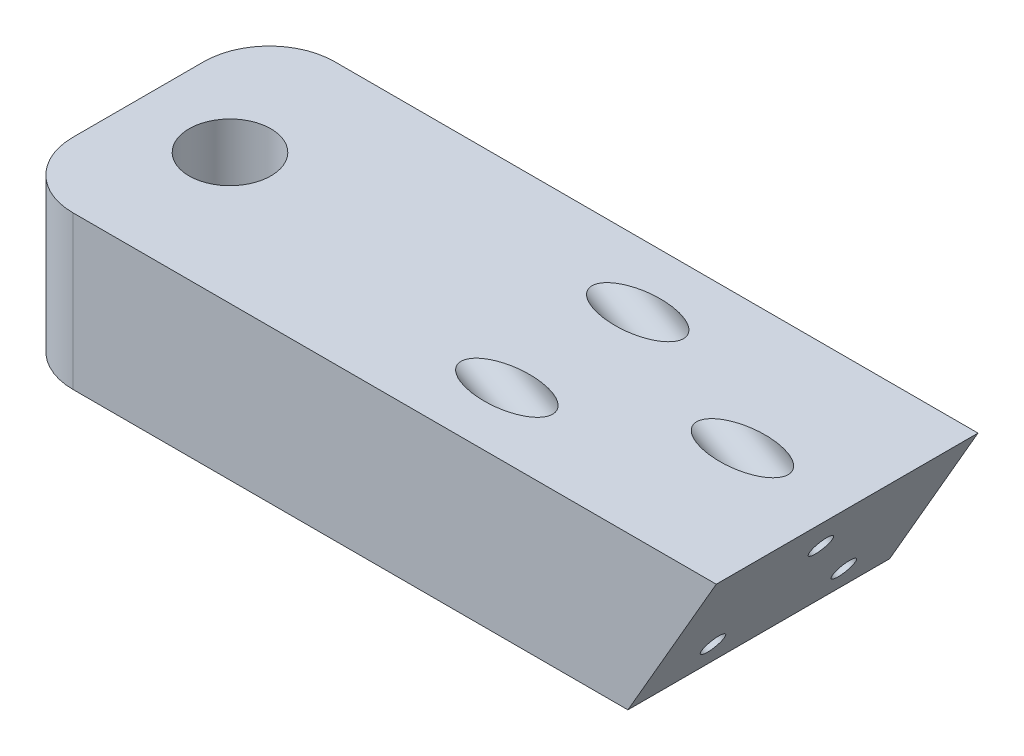
ISO-10303-21;
HEADER;
FILE_DESCRIPTION(('STEP AP214'),'2;1');
FILE_NAME('part.step','',(''),(''),'','','');
FILE_SCHEMA(('AUTOMOTIVE_DESIGN { 1 0 10303 214 1 1 1 1 }'));
ENDSEC;
DATA;
#1=APPLICATION_CONTEXT('core data for automotive mechanical design processes');
#2=APPLICATION_PROTOCOL_DEFINITION('international standard','automotive_design',2000,#1);
#3=PRODUCT_CONTEXT('',#1,'mechanical');
#4=PRODUCT('Part','Part','',(#3));
#5=PRODUCT_RELATED_PRODUCT_CATEGORY('part','',(#4));
#6=PRODUCT_DEFINITION_FORMATION('','',#4);
#7=PRODUCT_DEFINITION_CONTEXT('part definition',#1,'design');
#8=PRODUCT_DEFINITION('design','',#6,#7);
#9=PRODUCT_DEFINITION_SHAPE('','',#8);
#10=(LENGTH_UNIT() NAMED_UNIT(*) SI_UNIT(.MILLI.,.METRE.));
#11=(NAMED_UNIT(*) PLANE_ANGLE_UNIT() SI_UNIT($,.RADIAN.));
#12=(NAMED_UNIT(*) SI_UNIT($,.STERADIAN.) SOLID_ANGLE_UNIT());
#13=UNCERTAINTY_MEASURE_WITH_UNIT(LENGTH_MEASURE(1.E-05),#10,'distance_accuracy_value','');
#14=(GEOMETRIC_REPRESENTATION_CONTEXT(3) GLOBAL_UNCERTAINTY_ASSIGNED_CONTEXT((#13)) GLOBAL_UNIT_ASSIGNED_CONTEXT((#10,
#11,#12)) REPRESENTATION_CONTEXT('',''));
#15=CARTESIAN_POINT('',(0.,0.,0.));
#16=DIRECTION('',(0.,0.,1.));
#17=DIRECTION('',(1.,0.,0.));
#18=AXIS2_PLACEMENT_3D('',#15,#16,#17);
#19=CARTESIAN_POINT('',(-13.9992872394734,32.1506350946109,40.));
#20=DIRECTION('',(0.,-1.,0.));
#21=DIRECTION('',(1.,0.,0.));
#22=AXIS2_PLACEMENT_3D('',#19,#20,#21);
#23=PLANE('',#22);
#24=CARTESIAN_POINT('',(52.3134665205247,32.1506350946109,30.));
#25=DIRECTION('',(0.,-1.,0.));
#26=DIRECTION('',(1.,0.,0.));
#27=AXIS2_PLACEMENT_3D('',#24,#25,#26);
#28=ELLIPSE('',#27,7.00000000000014,3.5);
#29=CARTESIAN_POINT('',(59.3134665205249,32.1506350946109,30.));
#30=VERTEX_POINT('',#29);
#31=EDGE_CURVE('E330',#30,#30,#28,.F.);
#32=ORIENTED_EDGE('',*,*,#31,.F.);
#33=EDGE_LOOP('',(#32));
#34=FACE_BOUND('',#33,.T.);
#35=CARTESIAN_POINT('',(78.3134665205253,32.1506350946109,20.));
#36=DIRECTION('',(0.,-1.,0.));
#37=DIRECTION('',(1.,0.,0.));
#38=AXIS2_PLACEMENT_3D('',#35,#36,#37);
#39=ELLIPSE('',#38,7.00000000000013,3.5);
#40=CARTESIAN_POINT('',(85.3134665205255,32.1506350946109,20.));
#41=VERTEX_POINT('',#40);
#42=EDGE_CURVE('E346',#41,#41,#39,.F.);
#43=ORIENTED_EDGE('',*,*,#42,.F.);
#44=EDGE_LOOP('',(#43));
#45=FACE_BOUND('',#44,.T.);
#46=CARTESIAN_POINT('',(52.3134665205248,32.1506350946109,10.));
#47=DIRECTION('',(0.,-1.,0.));
#48=DIRECTION('',(1.,0.,0.));
#49=AXIS2_PLACEMENT_3D('',#46,#47,#48);
#50=ELLIPSE('',#49,7.00000000000014,3.5);
#51=CARTESIAN_POINT('',(59.3134665205249,32.1506350946109,10.));
#52=VERTEX_POINT('',#51);
#53=EDGE_CURVE('E343',#52,#52,#50,.F.);
#54=ORIENTED_EDGE('',*,*,#53,.F.);
#55=EDGE_LOOP('',(#54));
#56=FACE_BOUND('',#55,.T.);
#57=CARTESIAN_POINT('',(0.,32.1506350946109,20.));
#58=DIRECTION('',(0.,1.,0.));
#59=DIRECTION('',(0.,0.,1.));
#60=AXIS2_PLACEMENT_3D('',#57,#58,#59);
#61=CIRCLE('',#60,6.25);
#62=CARTESIAN_POINT('',(0.,32.1506350946109,26.25));
#63=VERTEX_POINT('',#62);
#64=EDGE_CURVE('E153',#63,#63,#61,.T.);
#65=ORIENTED_EDGE('',*,*,#64,.F.);
#66=EDGE_LOOP('',(#65));
#67=FACE_BOUND('',#66,.T.);
#68=DIRECTION('',(-1.,0.,0.));
#69=VECTOR('',#68,1.);
#70=CARTESIAN_POINT('',(-13.9992872394734,32.1506350946109,0.));
#71=LINE('',#70,#69);
#72=CARTESIAN_POINT('',(94.3134665205266,32.1506350946109,0.));
#73=VERTEX_POINT('',#72);
#74=CARTESIAN_POINT('',(-3.99928723947336,32.1506350946109,0.));
#75=VERTEX_POINT('',#74);
#76=EDGE_CURVE('E121',#73,#75,#71,.T.);
#77=ORIENTED_EDGE('',*,*,#76,.T.);
#78=CARTESIAN_POINT('',(-3.99928723947336,32.1506350946109,10.));
#79=DIRECTION('',(0.,-1.,0.));
#80=DIRECTION('',(1.,0.,0.));
#81=AXIS2_PLACEMENT_3D('',#78,#79,#80);
#82=CIRCLE('',#81,10.);
#83=CARTESIAN_POINT('',(-13.9992872394734,32.1506350946109,10.));
#84=VERTEX_POINT('',#83);
#85=EDGE_CURVE('E47',#75,#84,#82,.F.);
#86=ORIENTED_EDGE('',*,*,#85,.T.);
#87=DIRECTION('',(0.,0.,-1.));
#88=VECTOR('',#87,1.);
#89=CARTESIAN_POINT('',(-13.9992872394734,32.1506350946109,40.));
#90=LINE('',#89,#88);
#91=CARTESIAN_POINT('',(-13.9992872394734,32.1506350946109,30.));
#92=VERTEX_POINT('',#91);
#93=EDGE_CURVE('E128',#92,#84,#90,.T.);
#94=ORIENTED_EDGE('',*,*,#93,.F.);
#95=CARTESIAN_POINT('',(-3.99928723947336,32.1506350946109,30.));
#96=DIRECTION('',(0.,-1.,0.));
#97=DIRECTION('',(1.,0.,0.));
#98=AXIS2_PLACEMENT_3D('',#95,#96,#97);
#99=CIRCLE('',#98,10.);
#100=CARTESIAN_POINT('',(-3.99928723947336,32.1506350946109,40.));
#101=VERTEX_POINT('',#100);
#102=EDGE_CURVE('E54',#92,#101,#99,.F.);
#103=ORIENTED_EDGE('',*,*,#102,.T.);
#104=DIRECTION('',(-1.,0.,0.));
#105=VECTOR('',#104,1.);
#106=CARTESIAN_POINT('',(-13.9992872394734,32.1506350946109,40.));
#107=LINE('',#106,#105);
#108=CARTESIAN_POINT('',(94.3134665205266,32.1506350946109,40.));
#109=VERTEX_POINT('',#108);
#110=EDGE_CURVE('E103',#109,#101,#107,.T.);
#111=ORIENTED_EDGE('',*,*,#110,.F.);
#112=DIRECTION('',(0.,0.,-1.));
#113=VECTOR('',#112,1.);
#114=CARTESIAN_POINT('',(94.3134665205266,32.1506350946109,40.));
#115=LINE('',#114,#113);
#116=EDGE_CURVE('E113',#109,#73,#115,.T.);
#117=ORIENTED_EDGE('',*,*,#116,.T.);
#118=EDGE_LOOP('',(#77,#86,#94,#103,#111,#117));
#119=FACE_BOUND('',#118,.T.);
#120=ADVANCED_FACE('F39',(#34,#45,#56,#67,#119),#23,.F.);
#121=CARTESIAN_POINT('',(-13.9992872394736,8.7679491924309,40.));
#122=DIRECTION('',(1.,0.,0.));
#123=DIRECTION('',(0.,1.,0.));
#124=AXIS2_PLACEMENT_3D('',#121,#122,#123);
#125=PLANE('',#124);
#126=CARTESIAN_POINT('',(-13.9992872394736,20.150635094611,20.));
#127=DIRECTION('',(-1.,0.,0.));
#128=DIRECTION('',(0.,0.,1.));
#129=AXIS2_PLACEMENT_3D('',#126,#127,#128);
#130=CIRCLE('',#129,2.3);
#131=CARTESIAN_POINT('',(-13.9992872394736,20.150635094611,22.3));
#132=VERTEX_POINT('',#131);
#133=EDGE_CURVE('E156',#132,#132,#130,.T.);
#134=ORIENTED_EDGE('',*,*,#133,.F.);
#135=EDGE_LOOP('',(#134));
#136=FACE_BOUND('',#135,.T.);
#137=ORIENTED_EDGE('',*,*,#93,.T.);
#138=DIRECTION('',(0.,-1.,0.));
#139=VECTOR('',#138,1.);
#140=CARTESIAN_POINT('',(-13.9992872394736,8.7679491924309,10.));
#141=LINE('',#140,#139);
#142=CARTESIAN_POINT('',(-13.9992872394736,8.7679491924309,10.));
#143=VERTEX_POINT('',#142);
#144=EDGE_CURVE('E133',#84,#143,#141,.T.);
#145=ORIENTED_EDGE('',*,*,#144,.T.);
#146=DIRECTION('',(0.,0.,-1.));
#147=VECTOR('',#146,1.);
#148=CARTESIAN_POINT('',(-13.9992872394736,8.7679491924309,40.));
#149=LINE('',#148,#147);
#150=CARTESIAN_POINT('',(-13.9992872394736,8.7679491924309,30.));
#151=VERTEX_POINT('',#150);
#152=EDGE_CURVE('E112',#151,#143,#149,.T.);
#153=ORIENTED_EDGE('',*,*,#152,.F.);
#154=DIRECTION('',(0.,-1.,0.));
#155=VECTOR('',#154,1.);
#156=CARTESIAN_POINT('',(-13.9992872394734,32.1506350946109,30.));
#157=LINE('',#156,#155);
#158=EDGE_CURVE('E131',#151,#92,#157,.F.);
#159=ORIENTED_EDGE('',*,*,#158,.T.);
#160=EDGE_LOOP('',(#137,#145,#153,#159));
#161=FACE_BOUND('',#160,.T.);
#162=ADVANCED_FACE('F145',(#136,#161),#125,.F.);
#163=CARTESIAN_POINT('',(80.8134665205267,8.76794919243105,40.));
#164=DIRECTION('',(0.,1.,0.));
#165=DIRECTION('',(-1.,0.,0.));
#166=AXIS2_PLACEMENT_3D('',#163,#164,#165);
#167=PLANE('',#166);
#168=CARTESIAN_POINT('',(0.,8.76794919243092,20.));
#169=DIRECTION('',(0.,1.,0.));
#170=DIRECTION('',(-1.,0.,0.));
#171=AXIS2_PLACEMENT_3D('',#168,#169,#170);
#172=CIRCLE('',#171,6.25);
#173=CARTESIAN_POINT('',(-6.25,8.76794919243092,20.));
#174=VERTEX_POINT('',#173);
#175=EDGE_CURVE('E123',#174,#174,#172,.F.);
#176=ORIENTED_EDGE('',*,*,#175,.F.);
#177=EDGE_LOOP('',(#176));
#178=FACE_BOUND('',#177,.T.);
#179=ORIENTED_EDGE('',*,*,#152,.T.);
#180=CARTESIAN_POINT('',(-3.99928723947356,8.76794919243092,10.));
#181=DIRECTION('',(0.,1.,0.));
#182=DIRECTION('',(-1.,0.,0.));
#183=AXIS2_PLACEMENT_3D('',#180,#181,#182);
#184=CIRCLE('',#183,10.);
#185=CARTESIAN_POINT('',(-3.99928723947356,8.76794919243092,0.));
#186=VERTEX_POINT('',#185);
#187=EDGE_CURVE('E138',#143,#186,#184,.F.);
#188=ORIENTED_EDGE('',*,*,#187,.T.);
#189=DIRECTION('',(1.,0.,0.));
#190=VECTOR('',#189,1.);
#191=CARTESIAN_POINT('',(80.8134665205267,8.76794919243105,0.));
#192=LINE('',#191,#190);
#193=CARTESIAN_POINT('',(80.8134665205267,8.76794919243105,0.));
#194=VERTEX_POINT('',#193);
#195=EDGE_CURVE('E109',#186,#194,#192,.T.);
#196=ORIENTED_EDGE('',*,*,#195,.T.);
#197=DIRECTION('',(0.,0.,-1.));
#198=VECTOR('',#197,1.);
#199=CARTESIAN_POINT('',(80.8134665205267,8.76794919243105,40.));
#200=LINE('',#199,#198);
#201=CARTESIAN_POINT('',(80.8134665205267,8.76794919243105,40.));
#202=VERTEX_POINT('',#201);
#203=EDGE_CURVE('E106',#202,#194,#200,.T.);
#204=ORIENTED_EDGE('',*,*,#203,.F.);
#205=DIRECTION('',(1.,0.,0.));
#206=VECTOR('',#205,1.);
#207=CARTESIAN_POINT('',(80.8134665205267,8.76794919243105,40.));
#208=LINE('',#207,#206);
#209=CARTESIAN_POINT('',(-3.99928723947356,8.76794919243092,40.));
#210=VERTEX_POINT('',#209);
#211=EDGE_CURVE('E95',#210,#202,#208,.T.);
#212=ORIENTED_EDGE('',*,*,#211,.F.);
#213=CARTESIAN_POINT('',(-3.99928723947356,8.76794919243092,30.));
#214=DIRECTION('',(0.,1.,0.));
#215=DIRECTION('',(-1.,0.,0.));
#216=AXIS2_PLACEMENT_3D('',#213,#214,#215);
#217=CIRCLE('',#216,10.);
#218=EDGE_CURVE('E136',#210,#151,#217,.F.);
#219=ORIENTED_EDGE('',*,*,#218,.T.);
#220=EDGE_LOOP('',(#179,#188,#196,#204,#212,#219));
#221=FACE_BOUND('',#220,.T.);
#222=ADVANCED_FACE('F108',(#178,#221),#167,.F.);
#223=CARTESIAN_POINT('',(94.3134665205266,32.1506350946109,40.));
#224=DIRECTION('',(-0.866025403784441,0.499999999999996,0.));
#225=DIRECTION('',(-0.499999999999996,-0.866025403784441,0.));
#226=AXIS2_PLACEMENT_3D('',#223,#224,#225);
#227=PLANE('',#226);
#228=CARTESIAN_POINT('',(83.8134665205261,13.9641016151374,30.));
#229=DIRECTION('',(0.866025403784444,-0.49999999999999,0.));
#230=DIRECTION('',(0.49999999999999,0.866025403784444,0.));
#231=AXIS2_PLACEMENT_3D('',#228,#229,#230);
#232=CIRCLE('',#231,1.75);
#233=CARTESIAN_POINT('',(84.6884665205261,15.4796460717601,30.));
#234=VERTEX_POINT('',#233);
#235=EDGE_CURVE('E167',#234,#234,#232,.T.);
#236=ORIENTED_EDGE('',*,*,#235,.F.);
#237=EDGE_LOOP('',(#236));
#238=FACE_BOUND('',#237,.T.);
#239=CARTESIAN_POINT('',(83.8134665205261,13.9641016151374,10.));
#240=DIRECTION('',(0.866025403784444,-0.49999999999999,0.));
#241=DIRECTION('',(0.49999999999999,0.866025403784444,0.));
#242=AXIS2_PLACEMENT_3D('',#239,#240,#241);
#243=CIRCLE('',#242,1.75);
#244=CARTESIAN_POINT('',(84.6884665205261,15.4796460717601,10.));
#245=VERTEX_POINT('',#244);
#246=EDGE_CURVE('E326',#245,#245,#243,.T.);
#247=ORIENTED_EDGE('',*,*,#246,.F.);
#248=EDGE_LOOP('',(#247));
#249=FACE_BOUND('',#248,.T.);
#250=CARTESIAN_POINT('',(90.313466520526,25.2224318643351,20.));
#251=DIRECTION('',(0.866025403784444,-0.49999999999999,0.));
#252=DIRECTION('',(0.49999999999999,0.866025403784444,0.));
#253=AXIS2_PLACEMENT_3D('',#250,#251,#252);
#254=CIRCLE('',#253,1.75);
#255=CARTESIAN_POINT('',(91.188466520526,26.7379763209579,20.));
#256=VERTEX_POINT('',#255);
#257=EDGE_CURVE('E168',#256,#256,#254,.T.);
#258=ORIENTED_EDGE('',*,*,#257,.F.);
#259=EDGE_LOOP('',(#258));
#260=FACE_BOUND('',#259,.T.);
#261=DIRECTION('',(0.499999999999996,0.866025403784441,0.));
#262=VECTOR('',#261,1.);
#263=CARTESIAN_POINT('',(94.3134665205266,32.1506350946109,0.));
#264=LINE('',#263,#262);
#265=EDGE_CURVE('E125',#194,#73,#264,.T.);
#266=ORIENTED_EDGE('',*,*,#265,.T.);
#267=ORIENTED_EDGE('',*,*,#116,.F.);
#268=DIRECTION('',(0.499999999999996,0.866025403784441,0.));
#269=VECTOR('',#268,1.);
#270=CARTESIAN_POINT('',(94.3134665205266,32.1506350946109,40.));
#271=LINE('',#270,#269);
#272=EDGE_CURVE('E99',#202,#109,#271,.T.);
#273=ORIENTED_EDGE('',*,*,#272,.F.);
#274=ORIENTED_EDGE('',*,*,#203,.T.);
#275=EDGE_LOOP('',(#266,#267,#273,#274));
#276=FACE_BOUND('',#275,.T.);
#277=ADVANCED_FACE('F115',(#238,#249,#260,#276),#227,.F.);
#278=CARTESIAN_POINT('',(0.,0.,40.));
#279=DIRECTION('',(0.,0.,1.));
#280=DIRECTION('',(1.,0.,0.));
#281=AXIS2_PLACEMENT_3D('',#278,#279,#280);
#282=PLANE('',#281);
#283=ORIENTED_EDGE('',*,*,#110,.T.);
#284=DIRECTION('',(0.,-1.,0.));
#285=VECTOR('',#284,1.);
#286=CARTESIAN_POINT('',(-3.99928723947356,8.76794919243081,40.));
#287=LINE('',#286,#285);
#288=EDGE_CURVE('E11',#101,#210,#287,.T.);
#289=ORIENTED_EDGE('',*,*,#288,.T.);
#290=ORIENTED_EDGE('',*,*,#211,.T.);
#291=ORIENTED_EDGE('',*,*,#272,.T.);
#292=EDGE_LOOP('',(#283,#289,#290,#291));
#293=FACE_BOUND('',#292,.T.);
#294=ADVANCED_FACE('F97',(#293),#282,.T.);
#295=CARTESIAN_POINT('',(0.,0.,0.));
#296=DIRECTION('',(0.,0.,1.));
#297=DIRECTION('',(1.,0.,0.));
#298=AXIS2_PLACEMENT_3D('',#295,#296,#297);
#299=PLANE('',#298);
#300=ORIENTED_EDGE('',*,*,#195,.F.);
#301=DIRECTION('',(0.,-1.,0.));
#302=VECTOR('',#301,1.);
#303=CARTESIAN_POINT('',(-3.99928723947364,0.,0.));
#304=LINE('',#303,#302);
#305=EDGE_CURVE('E62',#186,#75,#304,.F.);
#306=ORIENTED_EDGE('',*,*,#305,.T.);
#307=ORIENTED_EDGE('',*,*,#76,.F.);
#308=ORIENTED_EDGE('',*,*,#265,.F.);
#309=EDGE_LOOP('',(#300,#306,#307,#308));
#310=FACE_BOUND('',#309,.T.);
#311=ADVANCED_FACE('F149',(#310),#299,.F.);
#312=CARTESIAN_POINT('',(0.,8.7669491924309,20.));
#313=DIRECTION('',(0.,1.,0.));
#314=DIRECTION('',(0.,0.,1.));
#315=AXIS2_PLACEMENT_3D('',#312,#313,#314);
#316=CYLINDRICAL_SURFACE('',#315,6.25);
#317=CARTESIAN_POINT('',(-5.81141118834315,20.150635094611,22.3));
#318=CARTESIAN_POINT('',(-5.81140767854029,20.0262349910175,22.3000038481121));
#319=CARTESIAN_POINT('',(-5.815449011967,19.9018608016973,22.2898736835966));
#320=CARTESIAN_POINT('',(-5.83106947619173,19.6568510429988,22.2497966904476));
#321=CARTESIAN_POINT('',(-5.84264860846846,19.5362154743537,22.2198498579266));
#322=CARTESIAN_POINT('',(-5.87185920641133,19.302285669965,22.1413778079585));
#323=CARTESIAN_POINT('',(-5.88947663886882,19.1889751299867,22.0928956373541));
#324=CARTESIAN_POINT('',(-5.92875658515922,18.9720528893392,21.9788808127611));
#325=CARTESIAN_POINT('',(-5.95042026386244,18.8684439945966,21.9133432465672));
#326=CARTESIAN_POINT('',(-5.99651288522111,18.668910520997,21.7637205584753));
#327=CARTESIAN_POINT('',(-6.02102110703377,18.5735159467542,21.6789528753252));
#328=CARTESIAN_POINT('',(-6.06937851653934,18.397924958151,21.4947258952571));
#329=CARTESIAN_POINT('',(-6.0932275693907,18.3177316340338,21.3952636183905));
#330=CARTESIAN_POINT('',(-6.13851753932007,18.172292826898,21.1804736957482));
#331=CARTESIAN_POINT('',(-6.15985461759466,18.10761980743,21.0647345724535));
#332=CARTESIAN_POINT('',(-6.19676691205868,17.9988803506946,20.8230960334692));
#333=CARTESIAN_POINT('',(-6.21234404676242,17.9548070508065,20.6972000178747));
#334=CARTESIAN_POINT('',(-6.23541878196318,17.8903660866304,20.4443909454117));
#335=CARTESIAN_POINT('',(-6.24322613728438,17.8690867570082,20.3177390914064));
#336=CARTESIAN_POINT('',(-6.25099115563097,17.8479205953181,20.0624375118087));
#337=CARTESIAN_POINT('',(-6.25095127713425,17.8480270632449,19.9337884245641));
#338=CARTESIAN_POINT('',(-6.24322563089208,17.8690902162203,19.6846643488513));
#339=CARTESIAN_POINT('',(-6.23590444276585,17.8890527036873,19.5640920520568));
#340=CARTESIAN_POINT('',(-6.21491337694768,17.947593830874,19.328146410934));
#341=CARTESIAN_POINT('',(-6.20124305181802,17.9861737826149,19.2127734336419));
#342=CARTESIAN_POINT('',(-6.16866891497011,18.0813365799642,18.9885379065182));
#343=CARTESIAN_POINT('',(-6.1496927734531,18.1381699772057,18.8797926290868));
#344=CARTESIAN_POINT('',(-6.1084370455403,18.2680075745326,18.6731165773091));
#345=CARTESIAN_POINT('',(-6.08615641653763,18.3410168819222,18.5751892332321));
#346=CARTESIAN_POINT('',(-6.03911059480564,18.5059635063816,18.3870601179165));
#347=CARTESIAN_POINT('',(-6.0142761510227,18.5987376487608,18.2976082542774));
#348=CARTESIAN_POINT('',(-5.96593865104424,18.7981312774686,18.1352565779265));
#349=CARTESIAN_POINT('',(-5.94243590517129,18.904753971992,18.0623606113898));
#350=CARTESIAN_POINT('',(-5.89899603621424,19.1316730611617,17.9338296756853));
#351=CARTESIAN_POINT('',(-5.87914270994335,19.2522066467475,17.8785828767576));
#352=CARTESIAN_POINT('',(-5.84621698564789,19.5017885045393,17.7894499051083));
#353=CARTESIAN_POINT('',(-5.83314098239039,19.6308322084732,17.7555523734617));
#354=CARTESIAN_POINT('',(-5.81609470171305,19.8863835774716,17.7117542545471));
#355=CARTESIAN_POINT('',(-5.81167479208995,20.0126577076175,17.7006671112486));
#356=CARTESIAN_POINT('',(-5.81117093983044,20.2653119576649,17.6993919011209));
#357=CARTESIAN_POINT('',(-5.81508502294152,20.3916920453765,17.7091988846499));
#358=CARTESIAN_POINT('',(-5.83035288726415,20.6350106010336,17.7483591797131));
#359=CARTESIAN_POINT('',(-5.8413636489487,20.7521179458297,17.7768122422075));
#360=CARTESIAN_POINT('',(-5.86918252239255,20.97984844487,17.8513336451783));
#361=CARTESIAN_POINT('',(-5.88599179503567,21.0904702955013,17.897405513207));
#362=CARTESIAN_POINT('',(-5.92427061299649,21.3065847004361,18.0077556321538));
#363=CARTESIAN_POINT('',(-5.94588807348452,21.4117418535316,18.0726379420992));
#364=CARTESIAN_POINT('',(-5.99109246055427,21.6100989161282,18.218117428066));
#365=CARTESIAN_POINT('',(-6.01468008287517,21.7032945718466,18.2987201690999));
#366=CARTESIAN_POINT('',(-6.06289586347118,21.8809418417153,18.4791396260854));
#367=CARTESIAN_POINT('',(-6.08750038593547,21.9645205471846,18.5798250701969));
#368=CARTESIAN_POINT('',(-6.13359994489274,22.1136919630067,18.7943975774288));
#369=CARTESIAN_POINT('',(-6.15509499765397,22.1792847674605,18.9082845714751));
#370=CARTESIAN_POINT('',(-6.19252033965522,22.290151024354,19.145849072022));
#371=CARTESIAN_POINT('',(-6.20847348073192,22.3355081433454,19.2694837307346));
#372=CARTESIAN_POINT('',(-6.2330995494715,22.4045388424011,19.5233457895695));
#373=CARTESIAN_POINT('',(-6.24177575614286,22.428222189171,19.6535701922541));
#374=CARTESIAN_POINT('',(-6.25057058711822,22.4522093115654,19.9090099309076));
#375=CARTESIAN_POINT('',(-6.25114386695718,22.4537552842037,20.0340940417738));
#376=CARTESIAN_POINT('',(-6.24484213172561,22.4365960852575,20.2826612614819));
#377=CARTESIAN_POINT('',(-6.23796795957721,22.4178932054913,20.4061445499085));
#378=CARTESIAN_POINT('',(-6.21774464601299,22.3616330435305,20.6451547602938));
#379=CARTESIAN_POINT('',(-6.20454665870154,22.3245152229397,20.7607988791777));
#380=CARTESIAN_POINT('',(-6.17304839275443,22.2329104209587,20.9842342863207));
#381=CARTESIAN_POINT('',(-6.15474715069333,22.1784201596079,21.0920240869396));
#382=CARTESIAN_POINT('',(-6.11394315325314,22.0510515555791,21.301562655162));
#383=CARTESIAN_POINT('',(-6.09129810238054,21.9775067841927,21.4028781319005));
#384=CARTESIAN_POINT('',(-6.04459903064423,21.8151813431459,21.5921178261504));
#385=CARTESIAN_POINT('',(-6.02054451675565,21.7263953209437,21.6800373186102));
#386=CARTESIAN_POINT('',(-5.97226142922329,21.530786643631,21.8445370168823));
#387=CARTESIAN_POINT('',(-5.948085083862,21.4232808827874,21.9203233036685));
#388=CARTESIAN_POINT('',(-5.90368841824011,21.1962936744162,22.0527693025034));
#389=CARTESIAN_POINT('',(-5.88346823129339,21.0768118235256,22.1094283700533));
#390=CARTESIAN_POINT('',(-5.84911422336388,20.8255519062438,22.2029389989425));
#391=CARTESIAN_POINT('',(-5.83516659986048,20.6935232765933,22.2391917630468));
#392=CARTESIAN_POINT('',(-5.81631969741031,20.4245290118423,22.2877130327907));
#393=CARTESIAN_POINT('',(-5.81141505169788,20.2875663541987,22.2999957642573));
#394=CARTESIAN_POINT('',(-5.81141118834315,20.150635094611,22.3));
#395=B_SPLINE_CURVE_WITH_KNOTS('',3,(#317,#318,#319,#320,#321,#322,#323,#324,#325,#326,#327,
#328,#329,#330,#331,#332,#333,#334,#335,#336,#337,#338,#339,#340,#341,#342,#343,#344,#345,#346,
#347,#348,#349,#350,#351,#352,#353,#354,#355,#356,#357,#358,#359,#360,#361,#362,#363,#364,#365,
#366,#367,#368,#369,#370,#371,#372,#373,#374,#375,#376,#377,#378,#379,#380,#381,#382,#383,#384,
#385,#386,#387,#388,#389,#390,#391,#392,#393,#394),.UNSPECIFIED.,.T.,.F.,(4,2,2,2,2,2,2,2,2,2,2,
2,2,2,2,2,2,2,2,2,2,2,2,2,2,2,2,2,2,2,2,2,2,2,2,2,2,2,4),(0.,0.372690900162198,
0.745381873435603,1.11721250852842,1.48915035507795,1.87726043496635,2.26544932885093,
2.66629198151893,3.06700100152962,3.45100487751708,3.83488844824171,4.20047181453637,
4.56608094820943,4.93693991815185,5.30791614861666,5.69986840836587,6.09191163138396,
6.49206304203581,6.89200137098572,7.27054805068109,7.64900506584121,8.01041660000108,
8.37190053215041,8.74660067926883,9.12143371130523,9.51899605822108,9.91655632507717,
10.3124572487237,10.7081796822377,11.0816039124423,11.4549858819295,11.8198574192142,
12.1847978859969,12.5648089341138,12.9449537115392,13.3442406471138,13.7435410354683,
14.1540177748008,14.5642508286478),.UNSPECIFIED.);
#396=CARTESIAN_POINT('',(-5.81141118834315,20.150635094611,22.3));
#397=VERTEX_POINT('',#396);
#398=EDGE_CURVE('E159',#397,#397,#395,.T.);
#399=ORIENTED_EDGE('',*,*,#398,.F.);
#400=EDGE_LOOP('',(#399));
#401=FACE_BOUND('',#400,.T.);
#402=ORIENTED_EDGE('',*,*,#64,.T.);
#403=EDGE_LOOP('',(#402));
#404=FACE_BOUND('',#403,.T.);
#405=ORIENTED_EDGE('',*,*,#175,.T.);
#406=EDGE_LOOP('',(#405));
#407=FACE_BOUND('',#406,.T.);
#408=ADVANCED_FACE('F227',(#401,#404,#407),#316,.F.);
#409=CARTESIAN_POINT('',(-3.99928723947356,8.76794919243081,10.));
#410=DIRECTION('',(0.,-1.,0.));
#411=DIRECTION('',(1.,0.,0.));
#412=AXIS2_PLACEMENT_3D('',#409,#410,#411);
#413=CYLINDRICAL_SURFACE('',#412,10.);
#414=ORIENTED_EDGE('',*,*,#85,.F.);
#415=ORIENTED_EDGE('',*,*,#305,.F.);
#416=ORIENTED_EDGE('',*,*,#187,.F.);
#417=ORIENTED_EDGE('',*,*,#144,.F.);
#418=EDGE_LOOP('',(#414,#415,#416,#417));
#419=FACE_BOUND('',#418,.T.);
#420=ADVANCED_FACE('F148',(#419),#413,.T.);
#421=CARTESIAN_POINT('',(-3.99928723947364,0.,30.));
#422=DIRECTION('',(0.,1.,0.));
#423=DIRECTION('',(-1.,0.,0.));
#424=AXIS2_PLACEMENT_3D('',#421,#422,#423);
#425=CYLINDRICAL_SURFACE('',#424,10.);
#426=ORIENTED_EDGE('',*,*,#102,.F.);
#427=ORIENTED_EDGE('',*,*,#158,.F.);
#428=ORIENTED_EDGE('',*,*,#218,.F.);
#429=ORIENTED_EDGE('',*,*,#288,.F.);
#430=EDGE_LOOP('',(#426,#427,#428,#429));
#431=FACE_BOUND('',#430,.T.);
#432=ADVANCED_FACE('F41',(#431),#425,.T.);
#433=CARTESIAN_POINT('',(94.3144665205267,20.150635094611,20.));
#434=DIRECTION('',(-1.,0.,0.));
#435=DIRECTION('',(0.,0.,1.));
#436=AXIS2_PLACEMENT_3D('',#433,#434,#435);
#437=CYLINDRICAL_SURFACE('',#436,2.3);
#438=ORIENTED_EDGE('',*,*,#133,.T.);
#439=EDGE_LOOP('',(#438));
#440=FACE_BOUND('',#439,.T.);
#441=ORIENTED_EDGE('',*,*,#398,.T.);
#442=EDGE_LOOP('',(#441));
#443=FACE_BOUND('',#442,.T.);
#444=ADVANCED_FACE('F170',(#440,#443),#437,.F.);
#445=CARTESIAN_POINT('',(9.07771818782325,72.1239130320405,20.));
#446=DIRECTION('',(0.866025403784444,-0.49999999999999,0.));
#447=DIRECTION('',(0.49999999999999,0.866025403784444,0.));
#448=AXIS2_PLACEMENT_3D('',#445,#446,#447);
#449=CYLINDRICAL_SURFACE('',#448,1.75);
#450=CARTESIAN_POINT('',(85.1173140978194,28.2224318643351,20.));
#451=DIRECTION('',(0.866025403784444,-0.49999999999999,0.));
#452=DIRECTION('',(0.49999999999999,0.866025403784444,0.));
#453=AXIS2_PLACEMENT_3D('',#450,#451,#452);
#454=CIRCLE('',#453,1.75);
#455=CARTESIAN_POINT('',(85.9923140978194,29.7379763209578,20.));
#456=VERTEX_POINT('',#455);
#457=EDGE_CURVE('E342',#456,#456,#454,.T.);
#458=ORIENTED_EDGE('',*,*,#457,.F.);
#459=EDGE_LOOP('',(#458));
#460=FACE_BOUND('',#459,.T.);
#461=ORIENTED_EDGE('',*,*,#257,.T.);
#462=EDGE_LOOP('',(#461));
#463=FACE_BOUND('',#462,.T.);
#464=ADVANCED_FACE('F175',(#460,#463),#449,.F.);
#465=CARTESIAN_POINT('',(2.57771818782339,60.8655827828428,10.));
#466=DIRECTION('',(0.866025403784444,-0.49999999999999,0.));
#467=DIRECTION('',(0.49999999999999,0.866025403784444,0.));
#468=AXIS2_PLACEMENT_3D('',#465,#466,#467);
#469=CYLINDRICAL_SURFACE('',#468,1.75);
#470=CARTESIAN_POINT('',(78.6173140978195,16.9641016151373,10.));
#471=DIRECTION('',(0.866025403784444,-0.49999999999999,0.));
#472=DIRECTION('',(0.49999999999999,0.866025403784444,0.));
#473=AXIS2_PLACEMENT_3D('',#470,#471,#472);
#474=CIRCLE('',#473,1.75);
#475=CARTESIAN_POINT('',(79.4923140978195,18.4796460717601,10.));
#476=VERTEX_POINT('',#475);
#477=EDGE_CURVE('E352',#476,#476,#474,.T.);
#478=ORIENTED_EDGE('',*,*,#477,.F.);
#479=EDGE_LOOP('',(#478));
#480=FACE_BOUND('',#479,.T.);
#481=ORIENTED_EDGE('',*,*,#246,.T.);
#482=EDGE_LOOP('',(#481));
#483=FACE_BOUND('',#482,.T.);
#484=ADVANCED_FACE('F178',(#480,#483),#469,.F.);
#485=CARTESIAN_POINT('',(2.57771818782337,60.8655827828428,30.));
#486=DIRECTION('',(0.866025403784444,-0.49999999999999,0.));
#487=DIRECTION('',(0.49999999999999,0.866025403784444,0.));
#488=AXIS2_PLACEMENT_3D('',#485,#486,#487);
#489=CYLINDRICAL_SURFACE('',#488,1.75);
#490=CARTESIAN_POINT('',(78.6173140978195,16.9641016151373,30.));
#491=DIRECTION('',(0.866025403784444,-0.49999999999999,0.));
#492=DIRECTION('',(0.49999999999999,0.866025403784444,0.));
#493=AXIS2_PLACEMENT_3D('',#490,#491,#492);
#494=CIRCLE('',#493,1.75);
#495=CARTESIAN_POINT('',(79.4923140978195,18.4796460717601,30.));
#496=VERTEX_POINT('',#495);
#497=EDGE_CURVE('E332',#496,#496,#494,.T.);
#498=ORIENTED_EDGE('',*,*,#497,.F.);
#499=EDGE_LOOP('',(#498));
#500=FACE_BOUND('',#499,.T.);
#501=ORIENTED_EDGE('',*,*,#235,.T.);
#502=EDGE_LOOP('',(#501));
#503=FACE_BOUND('',#502,.T.);
#504=ADVANCED_FACE('F182',(#500,#503),#489,.F.);
#505=CARTESIAN_POINT('',(2.5777181878234,60.8655827828428,30.));
#506=DIRECTION('',(0.866025403784444,-0.49999999999999,0.));
#507=DIRECTION('',(0.49999999999999,0.866025403784444,0.));
#508=AXIS2_PLACEMENT_3D('',#505,#506,#507);
#509=CYLINDRICAL_SURFACE('',#508,3.5);
#510=CARTESIAN_POINT('',(78.6173140978195,16.9641016151373,30.));
#511=DIRECTION('',(0.866025403784444,-0.49999999999999,0.));
#512=DIRECTION('',(0.49999999999999,0.866025403784444,0.));
#513=AXIS2_PLACEMENT_3D('',#510,#511,#512);
#514=CIRCLE('',#513,3.5);
#515=CARTESIAN_POINT('',(80.3673140978195,19.9951905283829,30.));
#516=VERTEX_POINT('',#515);
#517=EDGE_CURVE('E335',#516,#516,#514,.T.);
#518=ORIENTED_EDGE('',*,*,#517,.T.);
#519=EDGE_LOOP('',(#518));
#520=FACE_BOUND('',#519,.T.);
#521=ORIENTED_EDGE('',*,*,#31,.T.);
#522=EDGE_LOOP('',(#521));
#523=FACE_BOUND('',#522,.T.);
#524=ADVANCED_FACE('F186',(#520,#523),#509,.F.);
#525=CARTESIAN_POINT('',(78.6173140978195,16.9641016151373,30.));
#526=DIRECTION('',(0.866025403784444,-0.49999999999999,0.));
#527=DIRECTION('',(0.49999999999999,0.866025403784444,0.));
#528=AXIS2_PLACEMENT_3D('',#525,#526,#527);
#529=PLANE('',#528);
#530=ORIENTED_EDGE('',*,*,#497,.T.);
#531=EDGE_LOOP('',(#530));
#532=FACE_BOUND('',#531,.T.);
#533=ORIENTED_EDGE('',*,*,#517,.F.);
#534=EDGE_LOOP('',(#533));
#535=FACE_BOUND('',#534,.T.);
#536=ADVANCED_FACE('F192',(#532,#535),#529,.F.);
#537=CARTESIAN_POINT('',(2.57771818782342,60.8655827828428,10.));
#538=DIRECTION('',(0.866025403784444,-0.49999999999999,0.));
#539=DIRECTION('',(0.49999999999999,0.866025403784444,0.));
#540=AXIS2_PLACEMENT_3D('',#537,#538,#539);
#541=CYLINDRICAL_SURFACE('',#540,3.5);
#542=CARTESIAN_POINT('',(78.6173140978195,16.9641016151373,10.));
#543=DIRECTION('',(0.866025403784444,-0.49999999999999,0.));
#544=DIRECTION('',(0.49999999999999,0.866025403784444,0.));
#545=AXIS2_PLACEMENT_3D('',#542,#543,#544);
#546=CIRCLE('',#545,3.5);
#547=CARTESIAN_POINT('',(80.3673140978195,19.9951905283829,10.));
#548=VERTEX_POINT('',#547);
#549=EDGE_CURVE('E349',#548,#548,#546,.T.);
#550=ORIENTED_EDGE('',*,*,#549,.T.);
#551=EDGE_LOOP('',(#550));
#552=FACE_BOUND('',#551,.T.);
#553=ORIENTED_EDGE('',*,*,#53,.T.);
#554=EDGE_LOOP('',(#553));
#555=FACE_BOUND('',#554,.T.);
#556=ADVANCED_FACE('F188',(#552,#555),#541,.F.);
#557=CARTESIAN_POINT('',(78.6173140978195,16.9641016151373,10.));
#558=DIRECTION('',(0.866025403784444,-0.49999999999999,0.));
#559=DIRECTION('',(0.49999999999999,0.866025403784444,0.));
#560=AXIS2_PLACEMENT_3D('',#557,#558,#559);
#561=PLANE('',#560);
#562=ORIENTED_EDGE('',*,*,#477,.T.);
#563=EDGE_LOOP('',(#562));
#564=FACE_BOUND('',#563,.T.);
#565=ORIENTED_EDGE('',*,*,#549,.F.);
#566=EDGE_LOOP('',(#565));
#567=FACE_BOUND('',#566,.T.);
#568=ADVANCED_FACE('F191',(#564,#567),#561,.F.);
#569=CARTESIAN_POINT('',(9.0777181878233,72.1239130320406,20.));
#570=DIRECTION('',(0.866025403784444,-0.49999999999999,0.));
#571=DIRECTION('',(0.49999999999999,0.866025403784444,0.));
#572=AXIS2_PLACEMENT_3D('',#569,#570,#571);
#573=CYLINDRICAL_SURFACE('',#572,3.5);
#574=CARTESIAN_POINT('',(85.1173140978194,28.2224318643351,20.));
#575=DIRECTION('',(0.866025403784444,-0.49999999999999,0.));
#576=DIRECTION('',(0.49999999999999,0.866025403784444,0.));
#577=AXIS2_PLACEMENT_3D('',#574,#575,#576);
#578=CIRCLE('',#577,3.5);
#579=CARTESIAN_POINT('',(86.8673140978193,31.2535207775807,20.));
#580=VERTEX_POINT('',#579);
#581=EDGE_CURVE('E339',#580,#580,#578,.T.);
#582=ORIENTED_EDGE('',*,*,#581,.T.);
#583=EDGE_LOOP('',(#582));
#584=FACE_BOUND('',#583,.T.);
#585=ORIENTED_EDGE('',*,*,#42,.T.);
#586=EDGE_LOOP('',(#585));
#587=FACE_BOUND('',#586,.T.);
#588=ADVANCED_FACE('F196',(#584,#587),#573,.F.);
#589=CARTESIAN_POINT('',(85.1173140978194,28.2224318643351,20.));
#590=DIRECTION('',(0.866025403784444,-0.49999999999999,0.));
#591=DIRECTION('',(0.49999999999999,0.866025403784444,0.));
#592=AXIS2_PLACEMENT_3D('',#589,#590,#591);
#593=PLANE('',#592);
#594=ORIENTED_EDGE('',*,*,#457,.T.);
#595=EDGE_LOOP('',(#594));
#596=FACE_BOUND('',#595,.T.);
#597=ORIENTED_EDGE('',*,*,#581,.F.);
#598=EDGE_LOOP('',(#597));
#599=FACE_BOUND('',#598,.T.);
#600=ADVANCED_FACE('F200',(#596,#599),#593,.F.);
#601=CLOSED_SHELL('',(#120,#162,#222,#277,#294,#311,#408,#420,#432,#444,#464,#484,#504,#524,
#536,#556,#568,#588,#600));
#602=MANIFOLD_SOLID_BREP('B2',#601);
#603=ADVANCED_BREP_SHAPE_REPRESENTATION('',(#18,#602),#14);
#604=SHAPE_DEFINITION_REPRESENTATION(#9,#603);
ENDSEC;
END-ISO-10303-21;
